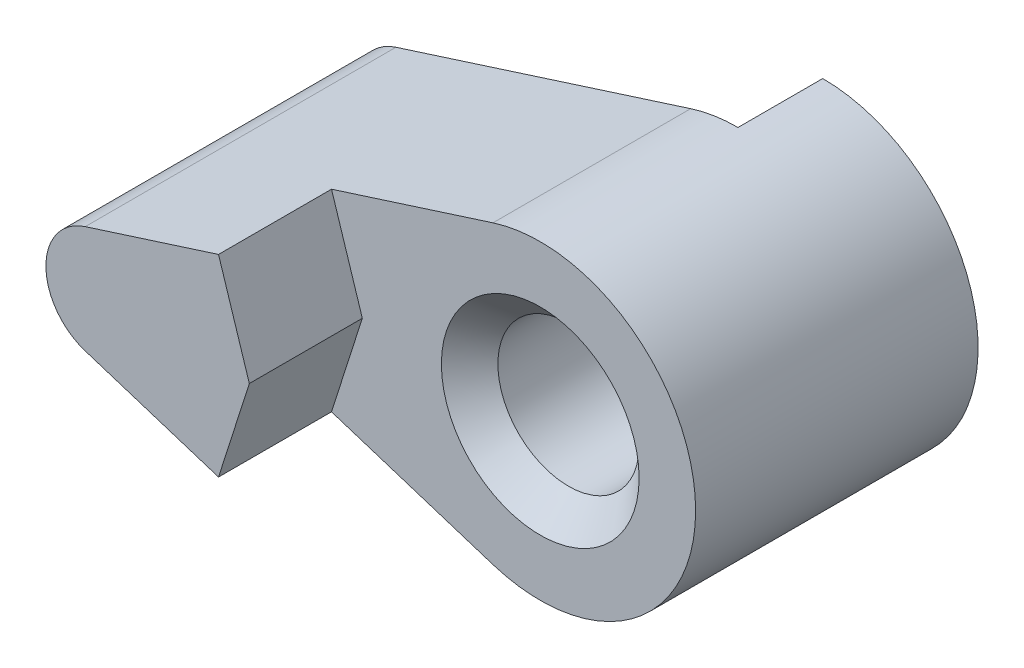
ISO-10303-21;
HEADER;
FILE_DESCRIPTION(('STEP AP214'),'2;1');
FILE_NAME('part.step','',(''),(''),'','','');
FILE_SCHEMA(('AUTOMOTIVE_DESIGN { 1 0 10303 214 1 1 1 1 }'));
ENDSEC;
DATA;
#1=APPLICATION_CONTEXT('core data for automotive mechanical design processes');
#2=APPLICATION_PROTOCOL_DEFINITION('international standard','automotive_design',2000,#1);
#3=PRODUCT_CONTEXT('',#1,'mechanical');
#4=PRODUCT('Part','Part','',(#3));
#5=PRODUCT_RELATED_PRODUCT_CATEGORY('part','',(#4));
#6=PRODUCT_DEFINITION_FORMATION('','',#4);
#7=PRODUCT_DEFINITION_CONTEXT('part definition',#1,'design');
#8=PRODUCT_DEFINITION('design','',#6,#7);
#9=PRODUCT_DEFINITION_SHAPE('','',#8);
#10=(LENGTH_UNIT() NAMED_UNIT(*) SI_UNIT(.MILLI.,.METRE.));
#11=(NAMED_UNIT(*) PLANE_ANGLE_UNIT() SI_UNIT($,.RADIAN.));
#12=(NAMED_UNIT(*) SI_UNIT($,.STERADIAN.) SOLID_ANGLE_UNIT());
#13=UNCERTAINTY_MEASURE_WITH_UNIT(LENGTH_MEASURE(1.E-05),#10,'distance_accuracy_value','');
#14=(GEOMETRIC_REPRESENTATION_CONTEXT(3) GLOBAL_UNCERTAINTY_ASSIGNED_CONTEXT((#13)) GLOBAL_UNIT_ASSIGNED_CONTEXT((#10,
#11,#12)) REPRESENTATION_CONTEXT('',''));
#15=CARTESIAN_POINT('',(0.,0.,0.));
#16=DIRECTION('',(0.,0.,1.));
#17=DIRECTION('',(1.,0.,0.));
#18=AXIS2_PLACEMENT_3D('',#15,#16,#17);
#19=CARTESIAN_POINT('',(-1.67391304347826,5.23908533265811,14.));
#20=DIRECTION('',(0.304347826086956,-0.952560969574202,0.));
#21=DIRECTION('',(0.952560969574202,0.304347826086957,0.));
#22=AXIS2_PLACEMENT_3D('',#19,#20,#21);
#23=PLANE('',#22);
#24=DIRECTION('',(-0.952560969574202,-0.304347826086957,0.));
#25=VECTOR('',#24,1.);
#26=CARTESIAN_POINT('',(-20.9265529123236,-0.912226003494337,3.));
#27=LINE('',#26,#25);
#28=CARTESIAN_POINT('',(-1.67391304347826,5.23908533265811,3.));
#29=VERTEX_POINT('',#28);
#30=CARTESIAN_POINT('',(-12.1086956521739,1.9051219391484,3.));
#31=VERTEX_POINT('',#30);
#32=EDGE_CURVE('E132',#29,#31,#27,.T.);
#33=ORIENTED_EDGE('',*,*,#32,.T.);
#34=DIRECTION('',(0.,0.,-1.));
#35=VECTOR('',#34,1.);
#36=CARTESIAN_POINT('',(-12.1086956521739,1.9051219391484,14.));
#37=LINE('',#36,#35);
#38=CARTESIAN_POINT('',(-12.1086956521739,1.9051219391484,14.));
#39=VERTEX_POINT('',#38);
#40=EDGE_CURVE('E200',#39,#31,#37,.T.);
#41=ORIENTED_EDGE('',*,*,#40,.F.);
#42=DIRECTION('',(-0.952560969574202,-0.304347826086957,0.));
#43=VECTOR('',#42,1.);
#44=CARTESIAN_POINT('',(-1.67391304347826,5.23908533265811,14.));
#45=LINE('',#44,#43);
#46=CARTESIAN_POINT('',(-7.38927886092347,3.41299837613637,14.));
#47=VERTEX_POINT('',#46);
#48=EDGE_CURVE('E186',#47,#39,#45,.T.);
#49=ORIENTED_EDGE('',*,*,#48,.F.);
#50=DIRECTION('',(0.,0.,1.));
#51=VECTOR('',#50,1.);
#52=CARTESIAN_POINT('',(-7.38927886092347,3.41299837613637,10.));
#53=LINE('',#52,#51);
#54=CARTESIAN_POINT('',(-7.38927886092347,3.41299837613637,10.));
#55=VERTEX_POINT('',#54);
#56=EDGE_CURVE('E171',#55,#47,#53,.T.);
#57=ORIENTED_EDGE('',*,*,#56,.F.);
#58=DIRECTION('',(-0.952560969574202,-0.304347826086957,0.));
#59=VECTOR('',#58,1.);
#60=CARTESIAN_POINT('',(-1.67391304347826,5.23908533265811,10.));
#61=LINE('',#60,#59);
#62=CARTESIAN_POINT('',(-1.67391304347826,5.23908533265811,10.));
#63=VERTEX_POINT('',#62);
#64=EDGE_CURVE('E162',#63,#55,#61,.T.);
#65=ORIENTED_EDGE('',*,*,#64,.F.);
#66=DIRECTION('',(0.,0.,-1.));
#67=VECTOR('',#66,1.);
#68=CARTESIAN_POINT('',(-1.67391304347826,5.23908533265811,14.));
#69=LINE('',#68,#67);
#70=EDGE_CURVE('E203',#63,#29,#69,.T.);
#71=ORIENTED_EDGE('',*,*,#70,.T.);
#72=EDGE_LOOP('',(#33,#41,#49,#57,#65,#71));
#73=FACE_BOUND('',#72,.T.);
#74=ADVANCED_FACE('F41',(#73),#23,.F.);
#75=CARTESIAN_POINT('',(-11.5,0.,14.));
#76=DIRECTION('',(0.,0.,-1.));
#77=DIRECTION('',(-1.,0.,0.));
#78=AXIS2_PLACEMENT_3D('',#75,#76,#77);
#79=CYLINDRICAL_SURFACE('',#78,2.);
#80=CARTESIAN_POINT('',(-11.5,0.,3.));
#81=DIRECTION('',(0.,0.,-1.));
#82=DIRECTION('',(-1.,0.,0.));
#83=AXIS2_PLACEMENT_3D('',#80,#81,#82);
#84=CIRCLE('',#83,2.);
#85=CARTESIAN_POINT('',(-12.1086956521739,-1.9051219391484,3.));
#86=VERTEX_POINT('',#85);
#87=EDGE_CURVE('E156',#31,#86,#84,.F.);
#88=ORIENTED_EDGE('',*,*,#87,.T.);
#89=DIRECTION('',(0.,0.,-1.));
#90=VECTOR('',#89,1.);
#91=CARTESIAN_POINT('',(-12.1086956521739,-1.9051219391484,14.));
#92=LINE('',#91,#90);
#93=CARTESIAN_POINT('',(-12.1086956521739,-1.9051219391484,14.));
#94=VERTEX_POINT('',#93);
#95=EDGE_CURVE('E197',#94,#86,#92,.T.);
#96=ORIENTED_EDGE('',*,*,#95,.F.);
#97=CARTESIAN_POINT('',(-11.5,0.,14.));
#98=DIRECTION('',(0.,0.,1.));
#99=DIRECTION('',(1.,0.,0.));
#100=AXIS2_PLACEMENT_3D('',#97,#98,#99);
#101=CIRCLE('',#100,2.);
#102=EDGE_CURVE('E188',#39,#94,#101,.T.);
#103=ORIENTED_EDGE('',*,*,#102,.F.);
#104=ORIENTED_EDGE('',*,*,#40,.T.);
#105=EDGE_LOOP('',(#88,#96,#103,#104));
#106=FACE_BOUND('',#105,.T.);
#107=ADVANCED_FACE('F218',(#106),#79,.T.);
#108=CARTESIAN_POINT('',(-12.1086956521739,-1.9051219391484,14.));
#109=DIRECTION('',(0.304347826086956,0.952560969574202,0.));
#110=DIRECTION('',(-0.952560969574202,0.304347826086956,0.));
#111=AXIS2_PLACEMENT_3D('',#108,#109,#110);
#112=PLANE('',#111);
#113=DIRECTION('',(0.952560969574202,-0.304347826086956,0.));
#114=VECTOR('',#113,1.);
#115=CARTESIAN_POINT('',(-20.9265529123236,0.912226003494337,3.));
#116=LINE('',#115,#114);
#117=CARTESIAN_POINT('',(-1.67391304347826,-5.23908533265811,3.));
#118=VERTEX_POINT('',#117);
#119=EDGE_CURVE('E273',#86,#118,#116,.T.);
#120=ORIENTED_EDGE('',*,*,#119,.T.);
#121=DIRECTION('',(0.,0.,-1.));
#122=VECTOR('',#121,1.);
#123=CARTESIAN_POINT('',(-1.67391304347826,-5.23908533265811,14.));
#124=LINE('',#123,#122);
#125=CARTESIAN_POINT('',(-1.67391304347826,-5.23908533265811,10.));
#126=VERTEX_POINT('',#125);
#127=EDGE_CURVE('E193',#126,#118,#124,.T.);
#128=ORIENTED_EDGE('',*,*,#127,.F.);
#129=DIRECTION('',(0.952560969574202,-0.304347826086957,0.));
#130=VECTOR('',#129,1.);
#131=CARTESIAN_POINT('',(-1.67391304347826,-5.23908533265811,10.));
#132=LINE('',#131,#130);
#133=CARTESIAN_POINT('',(-7.38927886092347,-3.41299837613637,10.));
#134=VERTEX_POINT('',#133);
#135=EDGE_CURVE('E169',#134,#126,#132,.T.);
#136=ORIENTED_EDGE('',*,*,#135,.F.);
#137=DIRECTION('',(0.,0.,1.));
#138=VECTOR('',#137,1.);
#139=CARTESIAN_POINT('',(-7.38927886092347,-3.41299837613637,10.));
#140=LINE('',#139,#138);
#141=CARTESIAN_POINT('',(-7.38927886092347,-3.41299837613637,14.));
#142=VERTEX_POINT('',#141);
#143=EDGE_CURVE('E177',#134,#142,#140,.T.);
#144=ORIENTED_EDGE('',*,*,#143,.T.);
#145=DIRECTION('',(0.952560969574202,-0.304347826086956,0.));
#146=VECTOR('',#145,1.);
#147=CARTESIAN_POINT('',(-12.1086956521739,-1.9051219391484,14.));
#148=LINE('',#147,#146);
#149=EDGE_CURVE('E190',#94,#142,#148,.T.);
#150=ORIENTED_EDGE('',*,*,#149,.F.);
#151=ORIENTED_EDGE('',*,*,#95,.T.);
#152=EDGE_LOOP('',(#120,#128,#136,#144,#150,#151));
#153=FACE_BOUND('',#152,.T.);
#154=ADVANCED_FACE('F224',(#153),#112,.F.);
#155=CARTESIAN_POINT('',(0.,0.,14.));
#156=DIRECTION('',(0.,0.,-1.));
#157=DIRECTION('',(-1.,0.,0.));
#158=AXIS2_PLACEMENT_3D('',#155,#156,#157);
#159=CYLINDRICAL_SURFACE('',#158,5.5);
#160=CARTESIAN_POINT('',(0.,0.,0.));
#161=DIRECTION('',(0.,0.,1.));
#162=DIRECTION('',(1.,0.,0.));
#163=AXIS2_PLACEMENT_3D('',#160,#161,#162);
#164=CIRCLE('',#163,5.5);
#165=CARTESIAN_POINT('',(1.88111078829118,-5.16830941432249,0.));
#166=VERTEX_POINT('',#165);
#167=CARTESIAN_POINT('',(0.,5.5,0.));
#168=VERTEX_POINT('',#167);
#169=EDGE_CURVE('E152',#166,#168,#164,.T.);
#170=ORIENTED_EDGE('',*,*,#169,.T.);
#171=DIRECTION('',(0.,0.,-1.));
#172=VECTOR('',#171,1.);
#173=CARTESIAN_POINT('',(0.,5.5,3.));
#174=LINE('',#173,#172);
#175=CARTESIAN_POINT('',(0.,5.5,3.));
#176=VERTEX_POINT('',#175);
#177=EDGE_CURVE('E141',#176,#168,#174,.T.);
#178=ORIENTED_EDGE('',*,*,#177,.F.);
#179=CARTESIAN_POINT('',(0.,0.,3.));
#180=DIRECTION('',(0.,0.,-1.));
#181=DIRECTION('',(-1.,0.,0.));
#182=AXIS2_PLACEMENT_3D('',#179,#180,#181);
#183=CIRCLE('',#182,5.5);
#184=EDGE_CURVE('E125',#176,#29,#183,.F.);
#185=ORIENTED_EDGE('',*,*,#184,.T.);
#186=ORIENTED_EDGE('',*,*,#70,.F.);
#187=CARTESIAN_POINT('',(0.,0.,10.));
#188=DIRECTION('',(0.,0.,1.));
#189=DIRECTION('',(1.,0.,0.));
#190=AXIS2_PLACEMENT_3D('',#187,#188,#189);
#191=CIRCLE('',#190,5.5);
#192=EDGE_CURVE('E160',#126,#63,#191,.T.);
#193=ORIENTED_EDGE('',*,*,#192,.F.);
#194=ORIENTED_EDGE('',*,*,#127,.T.);
#195=CARTESIAN_POINT('',(1.88111078829118,-5.16830941432249,3.));
#196=VERTEX_POINT('',#195);
#197=EDGE_CURVE('E56',#118,#196,#183,.F.);
#198=ORIENTED_EDGE('',*,*,#197,.T.);
#199=DIRECTION('',(0.,0.,-1.));
#200=VECTOR('',#199,1.);
#201=CARTESIAN_POINT('',(1.88111078829118,-5.16830941432249,3.));
#202=LINE('',#201,#200);
#203=EDGE_CURVE('E175',#196,#166,#202,.T.);
#204=ORIENTED_EDGE('',*,*,#203,.T.);
#205=EDGE_LOOP('',(#170,#178,#185,#186,#193,#194,#198,#204));
#206=FACE_BOUND('',#205,.T.);
#207=ADVANCED_FACE('F149',(#206),#159,.T.);
#208=CARTESIAN_POINT('',(0.,0.,14.));
#209=DIRECTION('',(0.,0.,-1.));
#210=DIRECTION('',(-1.,0.,0.));
#211=AXIS2_PLACEMENT_3D('',#208,#209,#210);
#212=CYLINDRICAL_SURFACE('',#211,2.5);
#213=CARTESIAN_POINT('',(0.,0.,9.));
#214=DIRECTION('',(0.,0.,1.));
#215=DIRECTION('',(1.,0.,0.));
#216=AXIS2_PLACEMENT_3D('',#213,#214,#215);
#217=CIRCLE('',#216,2.5);
#218=CARTESIAN_POINT('',(2.5,0.,9.));
#219=VERTEX_POINT('',#218);
#220=EDGE_CURVE('E49',#219,#219,#217,.T.);
#221=ORIENTED_EDGE('',*,*,#220,.T.);
#222=EDGE_LOOP('',(#221));
#223=FACE_BOUND('',#222,.T.);
#224=DIRECTION('',(0.,0.,-1.));
#225=VECTOR('',#224,1.);
#226=CARTESIAN_POINT('',(1.34174848841226,-2.10943380883199,3.));
#227=LINE('',#226,#225);
#228=CARTESIAN_POINT('',(1.34174848841226,-2.10943380883199,3.));
#229=VERTEX_POINT('',#228);
#230=CARTESIAN_POINT('',(1.34174848841226,-2.10943380883199,0.));
#231=VERTEX_POINT('',#230);
#232=EDGE_CURVE('E154',#229,#231,#227,.T.);
#233=ORIENTED_EDGE('',*,*,#232,.F.);
#234=CARTESIAN_POINT('',(0.,0.,3.));
#235=DIRECTION('',(0.,0.,-1.));
#236=DIRECTION('',(-1.,0.,0.));
#237=AXIS2_PLACEMENT_3D('',#234,#235,#236);
#238=CIRCLE('',#237,2.5);
#239=CARTESIAN_POINT('',(0.539362299878918,2.44112439450949,3.));
#240=VERTEX_POINT('',#239);
#241=EDGE_CURVE('E145',#240,#229,#238,.F.);
#242=ORIENTED_EDGE('',*,*,#241,.F.);
#243=DIRECTION('',(0.,0.,-1.));
#244=VECTOR('',#243,1.);
#245=CARTESIAN_POINT('',(0.539362299878918,2.44112439450949,3.));
#246=LINE('',#245,#244);
#247=CARTESIAN_POINT('',(0.539362299878918,2.44112439450949,0.));
#248=VERTEX_POINT('',#247);
#249=EDGE_CURVE('E144',#240,#248,#246,.T.);
#250=ORIENTED_EDGE('',*,*,#249,.T.);
#251=CARTESIAN_POINT('',(0.,0.,0.));
#252=DIRECTION('',(0.,0.,1.));
#253=DIRECTION('',(1.,0.,0.));
#254=AXIS2_PLACEMENT_3D('',#251,#252,#253);
#255=CIRCLE('',#254,2.5);
#256=EDGE_CURVE('E180',#231,#248,#255,.T.);
#257=ORIENTED_EDGE('',*,*,#256,.F.);
#258=EDGE_LOOP('',(#233,#242,#250,#257));
#259=FACE_BOUND('',#258,.T.);
#260=ADVANCED_FACE('F207',(#223,#259),#212,.F.);
#261=CARTESIAN_POINT('',(0.,0.,14.));
#262=DIRECTION('',(0.,0.,1.));
#263=DIRECTION('',(1.,0.,0.));
#264=AXIS2_PLACEMENT_3D('',#261,#262,#263);
#265=PLANE('',#264);
#266=DIRECTION('',(-0.304347826086957,-0.952560969574202,0.));
#267=VECTOR('',#266,1.);
#268=CARTESIAN_POINT('',(-6.29880941130941,0.,14.));
#269=LINE('',#268,#267);
#270=CARTESIAN_POINT('',(-6.29880941130941,0.,14.));
#271=VERTEX_POINT('',#270);
#272=EDGE_CURVE('E163',#271,#142,#269,.T.);
#273=ORIENTED_EDGE('',*,*,#272,.F.);
#274=DIRECTION('',(0.304347826086957,-0.952560969574202,0.));
#275=VECTOR('',#274,1.);
#276=CARTESIAN_POINT('',(-7.38927886092347,3.41299837613637,14.));
#277=LINE('',#276,#275);
#278=EDGE_CURVE('E172',#47,#271,#277,.T.);
#279=ORIENTED_EDGE('',*,*,#278,.F.);
#280=ORIENTED_EDGE('',*,*,#48,.T.);
#281=ORIENTED_EDGE('',*,*,#102,.T.);
#282=ORIENTED_EDGE('',*,*,#149,.T.);
#283=EDGE_LOOP('',(#273,#279,#280,#281,#282));
#284=FACE_BOUND('',#283,.T.);
#285=ADVANCED_FACE('F233',(#284),#265,.T.);
#286=CARTESIAN_POINT('',(0.,0.,0.));
#287=DIRECTION('',(0.,0.,1.));
#288=DIRECTION('',(1.,0.,0.));
#289=AXIS2_PLACEMENT_3D('',#286,#287,#288);
#290=PLANE('',#289);
#291=ORIENTED_EDGE('',*,*,#169,.F.);
#292=DIRECTION('',(0.173648177666931,-0.984807753012208,0.));
#293=VECTOR('',#292,1.);
#294=CARTESIAN_POINT('',(0.300754000321379,3.79433930580006,0.));
#295=LINE('',#294,#293);
#296=EDGE_CURVE('E137',#231,#166,#295,.T.);
#297=ORIENTED_EDGE('',*,*,#296,.F.);
#298=ORIENTED_EDGE('',*,*,#256,.T.);
#299=EDGE_CURVE('E267',#168,#248,#295,.T.);
#300=ORIENTED_EDGE('',*,*,#299,.F.);
#301=EDGE_LOOP('',(#291,#297,#298,#300));
#302=FACE_BOUND('',#301,.T.);
#303=ADVANCED_FACE('F239',(#302),#290,.F.);
#304=CARTESIAN_POINT('',(-6.29880941130941,0.,10.));
#305=DIRECTION('',(-0.952560969574202,0.304347826086957,0.));
#306=DIRECTION('',(-0.304347826086957,-0.952560969574202,0.));
#307=AXIS2_PLACEMENT_3D('',#304,#305,#306);
#308=PLANE('',#307);
#309=ORIENTED_EDGE('',*,*,#272,.T.);
#310=ORIENTED_EDGE('',*,*,#143,.F.);
#311=DIRECTION('',(-0.304347826086957,-0.952560969574202,0.));
#312=VECTOR('',#311,1.);
#313=CARTESIAN_POINT('',(-6.29880941130941,0.,10.));
#314=LINE('',#313,#312);
#315=CARTESIAN_POINT('',(-6.29880941130941,0.,10.));
#316=VERTEX_POINT('',#315);
#317=EDGE_CURVE('E64',#316,#134,#314,.T.);
#318=ORIENTED_EDGE('',*,*,#317,.F.);
#319=DIRECTION('',(0.,0.,1.));
#320=VECTOR('',#319,1.);
#321=CARTESIAN_POINT('',(-6.29880941130941,0.,10.));
#322=LINE('',#321,#320);
#323=EDGE_CURVE('E181',#316,#271,#322,.T.);
#324=ORIENTED_EDGE('',*,*,#323,.T.);
#325=EDGE_LOOP('',(#309,#310,#318,#324));
#326=FACE_BOUND('',#325,.T.);
#327=ADVANCED_FACE('F242',(#326),#308,.F.);
#328=CARTESIAN_POINT('',(-7.38927886092347,3.41299837613637,10.));
#329=DIRECTION('',(-0.952560969574202,-0.304347826086957,0.));
#330=DIRECTION('',(0.304347826086957,-0.952560969574202,0.));
#331=AXIS2_PLACEMENT_3D('',#328,#329,#330);
#332=PLANE('',#331);
#333=ORIENTED_EDGE('',*,*,#278,.T.);
#334=ORIENTED_EDGE('',*,*,#323,.F.);
#335=DIRECTION('',(0.304347826086957,-0.952560969574202,0.));
#336=VECTOR('',#335,1.);
#337=CARTESIAN_POINT('',(-7.38927886092347,3.41299837613637,10.));
#338=LINE('',#337,#336);
#339=EDGE_CURVE('E166',#55,#316,#338,.T.);
#340=ORIENTED_EDGE('',*,*,#339,.F.);
#341=ORIENTED_EDGE('',*,*,#56,.T.);
#342=EDGE_LOOP('',(#333,#334,#340,#341));
#343=FACE_BOUND('',#342,.T.);
#344=ADVANCED_FACE('F247',(#343),#332,.F.);
#345=CARTESIAN_POINT('',(0.,0.,10.));
#346=DIRECTION('',(0.,0.,1.));
#347=DIRECTION('',(1.,0.,0.));
#348=AXIS2_PLACEMENT_3D('',#345,#346,#347);
#349=PLANE('',#348);
#350=CARTESIAN_POINT('',(0.,0.,10.));
#351=DIRECTION('',(0.,0.,1.));
#352=DIRECTION('',(1.,0.,0.));
#353=AXIS2_PLACEMENT_3D('',#350,#351,#352);
#354=CIRCLE('',#353,3.50000000000001);
#355=CARTESIAN_POINT('',(3.50000000000001,0.,10.));
#356=VERTEX_POINT('',#355);
#357=EDGE_CURVE('E11',#356,#356,#354,.F.);
#358=ORIENTED_EDGE('',*,*,#357,.T.);
#359=EDGE_LOOP('',(#358));
#360=FACE_BOUND('',#359,.T.);
#361=ORIENTED_EDGE('',*,*,#192,.T.);
#362=ORIENTED_EDGE('',*,*,#64,.T.);
#363=ORIENTED_EDGE('',*,*,#339,.T.);
#364=ORIENTED_EDGE('',*,*,#317,.T.);
#365=ORIENTED_EDGE('',*,*,#135,.T.);
#366=EDGE_LOOP('',(#361,#362,#363,#364,#365));
#367=FACE_BOUND('',#366,.T.);
#368=ADVANCED_FACE('F250',(#360,#367),#349,.T.);
#369=CARTESIAN_POINT('',(0.300754000321379,3.79433930580006,3.));
#370=DIRECTION('',(0.984807753012208,0.173648177666931,0.));
#371=DIRECTION('',(-0.173648177666931,0.984807753012208,0.));
#372=AXIS2_PLACEMENT_3D('',#369,#370,#371);
#373=PLANE('',#372);
#374=ORIENTED_EDGE('',*,*,#296,.T.);
#375=ORIENTED_EDGE('',*,*,#203,.F.);
#376=DIRECTION('',(0.173648177666931,-0.984807753012208,0.));
#377=VECTOR('',#376,1.);
#378=CARTESIAN_POINT('',(0.300754000321379,3.79433930580006,3.));
#379=LINE('',#378,#377);
#380=EDGE_CURVE('E147',#229,#196,#379,.T.);
#381=ORIENTED_EDGE('',*,*,#380,.F.);
#382=ORIENTED_EDGE('',*,*,#232,.T.);
#383=EDGE_LOOP('',(#374,#375,#381,#382));
#384=FACE_BOUND('',#383,.T.);
#385=ADVANCED_FACE('F257',(#384),#373,.F.);
#386=ORIENTED_EDGE('',*,*,#299,.T.);
#387=ORIENTED_EDGE('',*,*,#249,.F.);
#388=EDGE_CURVE('E129',#176,#240,#379,.T.);
#389=ORIENTED_EDGE('',*,*,#388,.F.);
#390=ORIENTED_EDGE('',*,*,#177,.T.);
#391=EDGE_LOOP('',(#386,#387,#389,#390));
#392=FACE_BOUND('',#391,.T.);
#393=ADVANCED_FACE('F140',(#392),#373,.F.);
#394=CARTESIAN_POINT('',(-21.2180135221233,0.,3.));
#395=DIRECTION('',(0.,0.,-1.));
#396=DIRECTION('',(-1.,0.,0.));
#397=AXIS2_PLACEMENT_3D('',#394,#395,#396);
#398=PLANE('',#397);
#399=ORIENTED_EDGE('',*,*,#184,.F.);
#400=ORIENTED_EDGE('',*,*,#388,.T.);
#401=ORIENTED_EDGE('',*,*,#241,.T.);
#402=ORIENTED_EDGE('',*,*,#380,.T.);
#403=ORIENTED_EDGE('',*,*,#197,.F.);
#404=ORIENTED_EDGE('',*,*,#119,.F.);
#405=ORIENTED_EDGE('',*,*,#87,.F.);
#406=ORIENTED_EDGE('',*,*,#32,.F.);
#407=EDGE_LOOP('',(#399,#400,#401,#402,#403,#404,#405,#406));
#408=FACE_BOUND('',#407,.T.);
#409=ADVANCED_FACE('F127',(#408),#398,.T.);
#410=CARTESIAN_POINT('',(0.,0.,9.));
#411=DIRECTION('',(0.,0.,1.));
#412=DIRECTION('',(1.,0.,0.));
#413=AXIS2_PLACEMENT_3D('',#410,#411,#412);
#414=CONICAL_SURFACE('',#413,2.5,0.785398163397451);
#415=ORIENTED_EDGE('',*,*,#357,.F.);
#416=EDGE_LOOP('',(#415));
#417=FACE_BOUND('',#416,.T.);
#418=ORIENTED_EDGE('',*,*,#220,.F.);
#419=EDGE_LOOP('',(#418));
#420=FACE_BOUND('',#419,.T.);
#421=ADVANCED_FACE('F43',(#417,#420),#414,.F.);
#422=CLOSED_SHELL('',(#74,#107,#154,#207,#260,#285,#303,#327,#344,#368,#385,#393,#409,#421));
#423=MANIFOLD_SOLID_BREP('B2',#422);
#424=ADVANCED_BREP_SHAPE_REPRESENTATION('',(#18,#423),#14);
#425=SHAPE_DEFINITION_REPRESENTATION(#9,#424);
ENDSEC;
END-ISO-10303-21;
